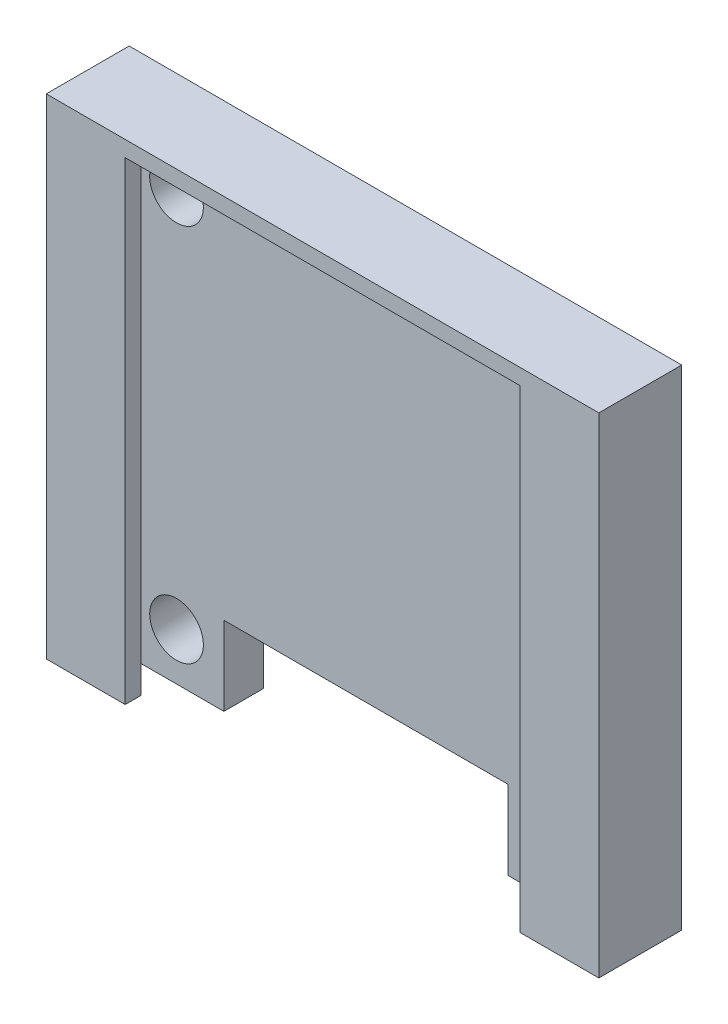
ISO-10303-21;
HEADER;
FILE_DESCRIPTION(('STEP AP214'),'2;1');
FILE_NAME('part.step','',(''),(''),'','','');
FILE_SCHEMA(('AUTOMOTIVE_DESIGN { 1 0 10303 214 1 1 1 1 }'));
ENDSEC;
DATA;
#1=APPLICATION_CONTEXT('core data for automotive mechanical design processes');
#2=APPLICATION_PROTOCOL_DEFINITION('international standard','automotive_design',2000,#1);
#3=PRODUCT_CONTEXT('',#1,'mechanical');
#4=PRODUCT('Part','Part','',(#3));
#5=PRODUCT_RELATED_PRODUCT_CATEGORY('part','',(#4));
#6=PRODUCT_DEFINITION_FORMATION('','',#4);
#7=PRODUCT_DEFINITION_CONTEXT('part definition',#1,'design');
#8=PRODUCT_DEFINITION('design','',#6,#7);
#9=PRODUCT_DEFINITION_SHAPE('','',#8);
#10=(LENGTH_UNIT() NAMED_UNIT(*) SI_UNIT(.MILLI.,.METRE.));
#11=(NAMED_UNIT(*) PLANE_ANGLE_UNIT() SI_UNIT($,.RADIAN.));
#12=(NAMED_UNIT(*) SI_UNIT($,.STERADIAN.) SOLID_ANGLE_UNIT());
#13=UNCERTAINTY_MEASURE_WITH_UNIT(LENGTH_MEASURE(1.E-05),#10,'distance_accuracy_value','');
#14=(GEOMETRIC_REPRESENTATION_CONTEXT(3) GLOBAL_UNCERTAINTY_ASSIGNED_CONTEXT((#13)) GLOBAL_UNIT_ASSIGNED_CONTEXT((#10,
#11,#12)) REPRESENTATION_CONTEXT('',''));
#15=CARTESIAN_POINT('',(0.,0.,0.));
#16=DIRECTION('',(0.,0.,1.));
#17=DIRECTION('',(1.,0.,0.));
#18=AXIS2_PLACEMENT_3D('',#15,#16,#17);
#19=CARTESIAN_POINT('',(0.,0.,2.5));
#20=DIRECTION('',(0.,0.,1.));
#21=DIRECTION('',(1.,0.,0.));
#22=AXIS2_PLACEMENT_3D('',#19,#20,#21);
#23=PLANE('',#22);
#24=CARTESIAN_POINT('',(29.5,27.,2.5));
#25=DIRECTION('',(0.,0.,-1.));
#26=DIRECTION('',(-1.,0.,0.));
#27=AXIS2_PLACEMENT_3D('',#24,#25,#26);
#28=CIRCLE('',#27,1.7);
#29=CARTESIAN_POINT('',(27.8,27.,2.5));
#30=VERTEX_POINT('',#29);
#31=EDGE_CURVE('E317',#30,#30,#28,.T.);
#32=ORIENTED_EDGE('',*,*,#31,.T.);
#33=EDGE_LOOP('',(#32));
#34=FACE_BOUND('',#33,.T.);
#35=CARTESIAN_POINT('',(5.5,27.,2.5));
#36=DIRECTION('',(0.,0.,1.));
#37=DIRECTION('',(1.,0.,0.));
#38=AXIS2_PLACEMENT_3D('',#35,#36,#37);
#39=CIRCLE('',#38,1.7);
#40=CARTESIAN_POINT('',(7.2,27.,2.5));
#41=VERTEX_POINT('',#40);
#42=EDGE_CURVE('E335',#41,#41,#39,.T.);
#43=ORIENTED_EDGE('',*,*,#42,.F.);
#44=EDGE_LOOP('',(#43));
#45=FACE_BOUND('',#44,.T.);
#46=CARTESIAN_POINT('',(5.5,3.,2.5));
#47=DIRECTION('',(0.,0.,-1.));
#48=DIRECTION('',(-1.,0.,0.));
#49=AXIS2_PLACEMENT_3D('',#46,#47,#48);
#50=CIRCLE('',#49,1.7);
#51=CARTESIAN_POINT('',(3.8,3.,2.5));
#52=VERTEX_POINT('',#51);
#53=EDGE_CURVE('E329',#52,#52,#50,.T.);
#54=ORIENTED_EDGE('',*,*,#53,.T.);
#55=EDGE_LOOP('',(#54));
#56=FACE_BOUND('',#55,.T.);
#57=CARTESIAN_POINT('',(29.5,3.,2.5));
#58=DIRECTION('',(0.,0.,1.));
#59=DIRECTION('',(1.,0.,0.));
#60=AXIS2_PLACEMENT_3D('',#57,#58,#59);
#61=CIRCLE('',#60,1.7);
#62=CARTESIAN_POINT('',(31.2,3.,2.5));
#63=VERTEX_POINT('',#62);
#64=EDGE_CURVE('E323',#63,#63,#61,.T.);
#65=ORIENTED_EDGE('',*,*,#64,.F.);
#66=EDGE_LOOP('',(#65));
#67=FACE_BOUND('',#66,.T.);
#68=DIRECTION('',(1.,0.,0.));
#69=VECTOR('',#68,1.);
#70=CARTESIAN_POINT('',(0.,0.,2.5));
#71=LINE('',#70,#69);
#72=CARTESIAN_POINT('',(26.5,0.,2.5));
#73=VERTEX_POINT('',#72);
#74=CARTESIAN_POINT('',(32.4480950745121,0.,2.5));
#75=VERTEX_POINT('',#74);
#76=EDGE_CURVE('E344',#73,#75,#71,.T.);
#77=ORIENTED_EDGE('',*,*,#76,.T.);
#78=DIRECTION('',(0.,-1.,0.));
#79=VECTOR('',#78,1.);
#80=CARTESIAN_POINT('',(32.4480950745121,0.,2.5));
#81=LINE('',#80,#79);
#82=CARTESIAN_POINT('',(32.4480950745121,30.,2.5));
#83=VERTEX_POINT('',#82);
#84=EDGE_CURVE('E279',#83,#75,#81,.T.);
#85=ORIENTED_EDGE('',*,*,#84,.F.);
#86=DIRECTION('',(1.,0.,0.));
#87=VECTOR('',#86,1.);
#88=CARTESIAN_POINT('',(0.,30.,2.5));
#89=LINE('',#88,#87);
#90=CARTESIAN_POINT('',(2.55190492548787,30.,2.5));
#91=VERTEX_POINT('',#90);
#92=EDGE_CURVE('E343',#91,#83,#89,.T.);
#93=ORIENTED_EDGE('',*,*,#92,.F.);
#94=DIRECTION('',(0.,1.,0.));
#95=VECTOR('',#94,1.);
#96=CARTESIAN_POINT('',(2.55190492548787,0.,2.5));
#97=LINE('',#96,#95);
#98=CARTESIAN_POINT('',(2.55190492548787,0.,2.5));
#99=VERTEX_POINT('',#98);
#100=EDGE_CURVE('E109',#99,#91,#97,.T.);
#101=ORIENTED_EDGE('',*,*,#100,.F.);
#102=CARTESIAN_POINT('',(8.5,0.,2.5));
#103=VERTEX_POINT('',#102);
#104=EDGE_CURVE('E341',#99,#103,#71,.T.);
#105=ORIENTED_EDGE('',*,*,#104,.T.);
#106=DIRECTION('',(0.,-1.,0.));
#107=VECTOR('',#106,1.);
#108=CARTESIAN_POINT('',(8.5,0.,2.5));
#109=LINE('',#108,#107);
#110=CARTESIAN_POINT('',(8.5,5.,2.5));
#111=VERTEX_POINT('',#110);
#112=EDGE_CURVE('E299',#111,#103,#109,.T.);
#113=ORIENTED_EDGE('',*,*,#112,.F.);
#114=DIRECTION('',(-1.,0.,0.));
#115=VECTOR('',#114,1.);
#116=CARTESIAN_POINT('',(8.5,5.,2.5));
#117=LINE('',#116,#115);
#118=CARTESIAN_POINT('',(26.5,5.,2.5));
#119=VERTEX_POINT('',#118);
#120=EDGE_CURVE('E305',#119,#111,#117,.T.);
#121=ORIENTED_EDGE('',*,*,#120,.F.);
#122=DIRECTION('',(0.,1.,0.));
#123=VECTOR('',#122,1.);
#124=CARTESIAN_POINT('',(26.5,0.,2.5));
#125=LINE('',#124,#123);
#126=EDGE_CURVE('E302',#73,#119,#125,.T.);
#127=ORIENTED_EDGE('',*,*,#126,.F.);
#128=EDGE_LOOP('',(#77,#85,#93,#101,#105,#113,#121,#127));
#129=FACE_BOUND('',#128,.T.);
#130=ADVANCED_FACE('F94',(#34,#45,#56,#67,#129),#23,.T.);
#131=CARTESIAN_POINT('',(0.,0.,2.5));
#132=DIRECTION('',(0.,1.,0.));
#133=DIRECTION('',(-1.,0.,0.));
#134=AXIS2_PLACEMENT_3D('',#131,#132,#133);
#135=PLANE('',#134);
#136=DIRECTION('',(1.,0.,0.));
#137=VECTOR('',#136,1.);
#138=CARTESIAN_POINT('',(0.,0.,0.));
#139=LINE('',#138,#137);
#140=CARTESIAN_POINT('',(0.,0.,0.));
#141=VERTEX_POINT('',#140);
#142=CARTESIAN_POINT('',(8.5,0.,0.));
#143=VERTEX_POINT('',#142);
#144=EDGE_CURVE('E346',#141,#143,#139,.T.);
#145=ORIENTED_EDGE('',*,*,#144,.T.);
#146=DIRECTION('',(0.,0.,1.));
#147=VECTOR('',#146,1.);
#148=CARTESIAN_POINT('',(8.5,0.,2.5));
#149=LINE('',#148,#147);
#150=EDGE_CURVE('E102',#143,#103,#149,.T.);
#151=ORIENTED_EDGE('',*,*,#150,.T.);
#152=ORIENTED_EDGE('',*,*,#104,.F.);
#153=DIRECTION('',(0.,0.,-1.));
#154=VECTOR('',#153,1.);
#155=CARTESIAN_POINT('',(2.55190492548787,0.,4.25));
#156=LINE('',#155,#154);
#157=CARTESIAN_POINT('',(2.55190492548787,0.,4.25));
#158=VERTEX_POINT('',#157);
#159=EDGE_CURVE('E296',#158,#99,#156,.T.);
#160=ORIENTED_EDGE('',*,*,#159,.F.);
#161=DIRECTION('',(1.,0.,0.));
#162=VECTOR('',#161,1.);
#163=CARTESIAN_POINT('',(0.,0.,4.25));
#164=LINE('',#163,#162);
#165=CARTESIAN_POINT('',(5.,0.,4.25));
#166=VERTEX_POINT('',#165);
#167=EDGE_CURVE('E265',#158,#166,#164,.T.);
#168=ORIENTED_EDGE('',*,*,#167,.T.);
#169=DIRECTION('',(0.,0.,-1.));
#170=VECTOR('',#169,1.);
#171=CARTESIAN_POINT('',(5.,0.,5.25));
#172=LINE('',#171,#170);
#173=CARTESIAN_POINT('',(5.,0.,5.25));
#174=VERTEX_POINT('',#173);
#175=EDGE_CURVE('E268',#174,#166,#172,.T.);
#176=ORIENTED_EDGE('',*,*,#175,.F.);
#177=DIRECTION('',(1.,0.,0.));
#178=VECTOR('',#177,1.);
#179=CARTESIAN_POINT('',(0.,0.,5.25));
#180=LINE('',#179,#178);
#181=CARTESIAN_POINT('',(0.,0.,5.25));
#182=VERTEX_POINT('',#181);
#183=EDGE_CURVE('E218',#182,#174,#180,.T.);
#184=ORIENTED_EDGE('',*,*,#183,.F.);
#185=DIRECTION('',(0.,0.,-1.));
#186=VECTOR('',#185,1.);
#187=CARTESIAN_POINT('',(0.,0.,2.5));
#188=LINE('',#187,#186);
#189=EDGE_CURVE('E215',#182,#141,#188,.T.);
#190=ORIENTED_EDGE('',*,*,#189,.T.);
#191=EDGE_LOOP('',(#145,#151,#152,#160,#168,#176,#184,#190));
#192=FACE_BOUND('',#191,.T.);
#193=ADVANCED_FACE('F360',(#192),#135,.F.);
#194=CARTESIAN_POINT('',(0.,0.,0.));
#195=DIRECTION('',(0.,0.,1.));
#196=DIRECTION('',(1.,0.,0.));
#197=AXIS2_PLACEMENT_3D('',#194,#195,#196);
#198=PLANE('',#197);
#199=CARTESIAN_POINT('',(29.5,27.,0.));
#200=DIRECTION('',(0.,0.,-1.));
#201=DIRECTION('',(-1.,0.,0.));
#202=AXIS2_PLACEMENT_3D('',#199,#200,#201);
#203=CIRCLE('',#202,1.7);
#204=CARTESIAN_POINT('',(27.8,27.,0.));
#205=VERTEX_POINT('',#204);
#206=EDGE_CURVE('E316',#205,#205,#203,.T.);
#207=ORIENTED_EDGE('',*,*,#206,.F.);
#208=EDGE_LOOP('',(#207));
#209=FACE_BOUND('',#208,.T.);
#210=CARTESIAN_POINT('',(5.5,3.,0.));
#211=DIRECTION('',(0.,0.,-1.));
#212=DIRECTION('',(-1.,0.,0.));
#213=AXIS2_PLACEMENT_3D('',#210,#211,#212);
#214=CIRCLE('',#213,1.7);
#215=CARTESIAN_POINT('',(3.8,3.,0.));
#216=VERTEX_POINT('',#215);
#217=EDGE_CURVE('E326',#216,#216,#214,.T.);
#218=ORIENTED_EDGE('',*,*,#217,.F.);
#219=EDGE_LOOP('',(#218));
#220=FACE_BOUND('',#219,.T.);
#221=DIRECTION('',(-1.,0.,0.));
#222=VECTOR('',#221,1.);
#223=CARTESIAN_POINT('',(0.,5.,0.));
#224=LINE('',#223,#222);
#225=CARTESIAN_POINT('',(26.5,5.,0.));
#226=VERTEX_POINT('',#225);
#227=CARTESIAN_POINT('',(8.5,5.,0.));
#228=VERTEX_POINT('',#227);
#229=EDGE_CURVE('E12',#226,#228,#224,.T.);
#230=ORIENTED_EDGE('',*,*,#229,.T.);
#231=DIRECTION('',(0.,-1.,0.));
#232=VECTOR('',#231,1.);
#233=CARTESIAN_POINT('',(8.5,0.,0.));
#234=LINE('',#233,#232);
#235=EDGE_CURVE('E313',#228,#143,#234,.T.);
#236=ORIENTED_EDGE('',*,*,#235,.T.);
#237=ORIENTED_EDGE('',*,*,#144,.F.);
#238=DIRECTION('',(0.,1.,0.));
#239=VECTOR('',#238,1.);
#240=CARTESIAN_POINT('',(0.,0.,0.));
#241=LINE('',#240,#239);
#242=CARTESIAN_POINT('',(0.,31.,0.));
#243=VERTEX_POINT('',#242);
#244=EDGE_CURVE('E351',#141,#243,#241,.T.);
#245=ORIENTED_EDGE('',*,*,#244,.T.);
#246=DIRECTION('',(-1.,0.,0.));
#247=VECTOR('',#246,1.);
#248=CARTESIAN_POINT('',(0.,31.,0.));
#249=LINE('',#248,#247);
#250=CARTESIAN_POINT('',(35.,31.,0.));
#251=VERTEX_POINT('',#250);
#252=EDGE_CURVE('E236',#251,#243,#249,.T.);
#253=ORIENTED_EDGE('',*,*,#252,.F.);
#254=DIRECTION('',(0.,1.,0.));
#255=VECTOR('',#254,1.);
#256=CARTESIAN_POINT('',(35.,0.,0.));
#257=LINE('',#256,#255);
#258=CARTESIAN_POINT('',(35.,0.,0.));
#259=VERTEX_POINT('',#258);
#260=EDGE_CURVE('E349',#259,#251,#257,.T.);
#261=ORIENTED_EDGE('',*,*,#260,.F.);
#262=CARTESIAN_POINT('',(26.5,0.,0.));
#263=VERTEX_POINT('',#262);
#264=EDGE_CURVE('E338',#263,#259,#139,.T.);
#265=ORIENTED_EDGE('',*,*,#264,.F.);
#266=DIRECTION('',(0.,1.,0.));
#267=VECTOR('',#266,1.);
#268=CARTESIAN_POINT('',(26.5,0.,0.));
#269=LINE('',#268,#267);
#270=EDGE_CURVE('E117',#263,#226,#269,.T.);
#271=ORIENTED_EDGE('',*,*,#270,.T.);
#272=EDGE_LOOP('',(#230,#236,#237,#245,#253,#261,#265,#271));
#273=FACE_BOUND('',#272,.T.);
#274=CARTESIAN_POINT('',(5.5,27.,0.));
#275=DIRECTION('',(0.,0.,1.));
#276=DIRECTION('',(1.,0.,0.));
#277=AXIS2_PLACEMENT_3D('',#274,#275,#276);
#278=CIRCLE('',#277,1.7);
#279=CARTESIAN_POINT('',(7.2,27.,0.));
#280=VERTEX_POINT('',#279);
#281=EDGE_CURVE('E332',#280,#280,#278,.T.);
#282=ORIENTED_EDGE('',*,*,#281,.T.);
#283=EDGE_LOOP('',(#282));
#284=FACE_BOUND('',#283,.T.);
#285=CARTESIAN_POINT('',(29.5,3.,0.));
#286=DIRECTION('',(0.,0.,1.));
#287=DIRECTION('',(1.,0.,0.));
#288=AXIS2_PLACEMENT_3D('',#285,#286,#287);
#289=CIRCLE('',#288,1.7);
#290=CARTESIAN_POINT('',(31.2,3.,0.));
#291=VERTEX_POINT('',#290);
#292=EDGE_CURVE('E320',#291,#291,#289,.T.);
#293=ORIENTED_EDGE('',*,*,#292,.T.);
#294=EDGE_LOOP('',(#293));
#295=FACE_BOUND('',#294,.T.);
#296=ADVANCED_FACE('F368',(#209,#220,#273,#284,#295),#198,.F.);
#297=ORIENTED_EDGE('',*,*,#76,.F.);
#298=DIRECTION('',(0.,0.,-1.));
#299=VECTOR('',#298,1.);
#300=CARTESIAN_POINT('',(26.5,0.,2.5));
#301=LINE('',#300,#299);
#302=EDGE_CURVE('E357',#73,#263,#301,.T.);
#303=ORIENTED_EDGE('',*,*,#302,.T.);
#304=ORIENTED_EDGE('',*,*,#264,.T.);
#305=DIRECTION('',(0.,0.,-1.));
#306=VECTOR('',#305,1.);
#307=CARTESIAN_POINT('',(35.,0.,2.5));
#308=LINE('',#307,#306);
#309=CARTESIAN_POINT('',(35.,0.,5.25));
#310=VERTEX_POINT('',#309);
#311=EDGE_CURVE('E354',#310,#259,#308,.T.);
#312=ORIENTED_EDGE('',*,*,#311,.F.);
#313=DIRECTION('',(-1.,0.,0.));
#314=VECTOR('',#313,1.);
#315=CARTESIAN_POINT('',(0.,0.,5.25));
#316=LINE('',#315,#314);
#317=CARTESIAN_POINT('',(30.,0.,5.25));
#318=VERTEX_POINT('',#317);
#319=EDGE_CURVE('E249',#310,#318,#316,.T.);
#320=ORIENTED_EDGE('',*,*,#319,.T.);
#321=DIRECTION('',(0.,0.,-1.));
#322=VECTOR('',#321,1.);
#323=CARTESIAN_POINT('',(30.,0.,5.25));
#324=LINE('',#323,#322);
#325=CARTESIAN_POINT('',(30.,0.,4.25));
#326=VERTEX_POINT('',#325);
#327=EDGE_CURVE('E252',#318,#326,#324,.T.);
#328=ORIENTED_EDGE('',*,*,#327,.T.);
#329=DIRECTION('',(-1.,0.,0.));
#330=VECTOR('',#329,1.);
#331=CARTESIAN_POINT('',(0.,0.,4.25));
#332=LINE('',#331,#330);
#333=CARTESIAN_POINT('',(32.4480950745121,0.,4.25));
#334=VERTEX_POINT('',#333);
#335=EDGE_CURVE('E247',#334,#326,#332,.T.);
#336=ORIENTED_EDGE('',*,*,#335,.F.);
#337=DIRECTION('',(0.,0.,-1.));
#338=VECTOR('',#337,1.);
#339=CARTESIAN_POINT('',(32.4480950745121,0.,4.25));
#340=LINE('',#339,#338);
#341=EDGE_CURVE('E283',#334,#75,#340,.T.);
#342=ORIENTED_EDGE('',*,*,#341,.T.);
#343=EDGE_LOOP('',(#297,#303,#304,#312,#320,#328,#336,#342));
#344=FACE_BOUND('',#343,.T.);
#345=ADVANCED_FACE('F96',(#344),#135,.F.);
#346=CARTESIAN_POINT('',(35.,0.,2.5));
#347=DIRECTION('',(-1.,0.,0.));
#348=DIRECTION('',(0.,0.,1.));
#349=AXIS2_PLACEMENT_3D('',#346,#347,#348);
#350=PLANE('',#349);
#351=ORIENTED_EDGE('',*,*,#260,.T.);
#352=DIRECTION('',(0.,0.,-1.));
#353=VECTOR('',#352,1.);
#354=CARTESIAN_POINT('',(35.,31.,0.));
#355=LINE('',#354,#353);
#356=CARTESIAN_POINT('',(35.,31.,5.25));
#357=VERTEX_POINT('',#356);
#358=EDGE_CURVE('E231',#357,#251,#355,.T.);
#359=ORIENTED_EDGE('',*,*,#358,.F.);
#360=DIRECTION('',(0.,-1.,0.));
#361=VECTOR('',#360,1.);
#362=CARTESIAN_POINT('',(35.,0.,5.25));
#363=LINE('',#362,#361);
#364=EDGE_CURVE('E227',#357,#310,#363,.T.);
#365=ORIENTED_EDGE('',*,*,#364,.T.);
#366=ORIENTED_EDGE('',*,*,#311,.T.);
#367=EDGE_LOOP('',(#351,#359,#365,#366));
#368=FACE_BOUND('',#367,.T.);
#369=ADVANCED_FACE('F394',(#368),#350,.F.);
#370=CARTESIAN_POINT('',(0.,0.,2.5));
#371=DIRECTION('',(-1.,0.,0.));
#372=DIRECTION('',(0.,-1.,0.));
#373=AXIS2_PLACEMENT_3D('',#370,#371,#372);
#374=PLANE('',#373);
#375=ORIENTED_EDGE('',*,*,#244,.F.);
#376=ORIENTED_EDGE('',*,*,#189,.F.);
#377=DIRECTION('',(0.,-1.,0.));
#378=VECTOR('',#377,1.);
#379=CARTESIAN_POINT('',(0.,0.,5.25));
#380=LINE('',#379,#378);
#381=CARTESIAN_POINT('',(0.,31.,5.25));
#382=VERTEX_POINT('',#381);
#383=EDGE_CURVE('E209',#382,#182,#380,.T.);
#384=ORIENTED_EDGE('',*,*,#383,.F.);
#385=DIRECTION('',(0.,0.,1.));
#386=VECTOR('',#385,1.);
#387=CARTESIAN_POINT('',(0.,31.,0.));
#388=LINE('',#387,#386);
#389=EDGE_CURVE('E214',#243,#382,#388,.T.);
#390=ORIENTED_EDGE('',*,*,#389,.F.);
#391=EDGE_LOOP('',(#375,#376,#384,#390));
#392=FACE_BOUND('',#391,.T.);
#393=ADVANCED_FACE('F212',(#392),#374,.T.);
#394=CARTESIAN_POINT('',(5.5,27.,2.5));
#395=DIRECTION('',(0.,0.,-1.));
#396=DIRECTION('',(-1.,0.,0.));
#397=AXIS2_PLACEMENT_3D('',#394,#395,#396);
#398=CYLINDRICAL_SURFACE('',#397,1.7);
#399=ORIENTED_EDGE('',*,*,#42,.T.);
#400=EDGE_LOOP('',(#399));
#401=FACE_BOUND('',#400,.T.);
#402=ORIENTED_EDGE('',*,*,#281,.F.);
#403=EDGE_LOOP('',(#402));
#404=FACE_BOUND('',#403,.T.);
#405=ADVANCED_FACE('F388',(#401,#404),#398,.F.);
#406=CARTESIAN_POINT('',(5.5,3.,2.5));
#407=DIRECTION('',(0.,0.,-1.));
#408=DIRECTION('',(-1.,0.,0.));
#409=AXIS2_PLACEMENT_3D('',#406,#407,#408);
#410=CYLINDRICAL_SURFACE('',#409,1.7);
#411=ORIENTED_EDGE('',*,*,#53,.F.);
#412=EDGE_LOOP('',(#411));
#413=FACE_BOUND('',#412,.T.);
#414=ORIENTED_EDGE('',*,*,#217,.T.);
#415=EDGE_LOOP('',(#414));
#416=FACE_BOUND('',#415,.T.);
#417=ADVANCED_FACE('F447',(#413,#416),#410,.F.);
#418=CARTESIAN_POINT('',(29.5,3.,2.5));
#419=DIRECTION('',(0.,0.,-1.));
#420=DIRECTION('',(-1.,0.,0.));
#421=AXIS2_PLACEMENT_3D('',#418,#419,#420);
#422=CYLINDRICAL_SURFACE('',#421,1.7);
#423=ORIENTED_EDGE('',*,*,#64,.T.);
#424=EDGE_LOOP('',(#423));
#425=FACE_BOUND('',#424,.T.);
#426=ORIENTED_EDGE('',*,*,#292,.F.);
#427=EDGE_LOOP('',(#426));
#428=FACE_BOUND('',#427,.T.);
#429=ADVANCED_FACE('F444',(#425,#428),#422,.F.);
#430=CARTESIAN_POINT('',(29.5,27.,2.5));
#431=DIRECTION('',(0.,0.,-1.));
#432=DIRECTION('',(-1.,0.,0.));
#433=AXIS2_PLACEMENT_3D('',#430,#431,#432);
#434=CYLINDRICAL_SURFACE('',#433,1.7);
#435=ORIENTED_EDGE('',*,*,#31,.F.);
#436=EDGE_LOOP('',(#435));
#437=FACE_BOUND('',#436,.T.);
#438=ORIENTED_EDGE('',*,*,#206,.T.);
#439=EDGE_LOOP('',(#438));
#440=FACE_BOUND('',#439,.T.);
#441=ADVANCED_FACE('F438',(#437,#440),#434,.F.);
#442=CARTESIAN_POINT('',(8.5,5.,-2.5));
#443=DIRECTION('',(0.,1.,0.));
#444=DIRECTION('',(0.,0.,1.));
#445=AXIS2_PLACEMENT_3D('',#442,#443,#444);
#446=PLANE('',#445);
#447=DIRECTION('',(0.,0.,1.));
#448=VECTOR('',#447,1.);
#449=CARTESIAN_POINT('',(26.5,5.,-2.5));
#450=LINE('',#449,#448);
#451=EDGE_CURVE('E308',#226,#119,#450,.T.);
#452=ORIENTED_EDGE('',*,*,#451,.T.);
#453=ORIENTED_EDGE('',*,*,#120,.T.);
#454=DIRECTION('',(0.,0.,1.));
#455=VECTOR('',#454,1.);
#456=CARTESIAN_POINT('',(8.5,5.,-2.5));
#457=LINE('',#456,#455);
#458=EDGE_CURVE('E309',#228,#111,#457,.T.);
#459=ORIENTED_EDGE('',*,*,#458,.F.);
#460=ORIENTED_EDGE('',*,*,#229,.F.);
#461=EDGE_LOOP('',(#452,#453,#459,#460));
#462=FACE_BOUND('',#461,.T.);
#463=ADVANCED_FACE('F372',(#462),#446,.F.);
#464=CARTESIAN_POINT('',(8.5,0.,-2.5));
#465=DIRECTION('',(-1.,0.,0.));
#466=DIRECTION('',(0.,0.,1.));
#467=AXIS2_PLACEMENT_3D('',#464,#465,#466);
#468=PLANE('',#467);
#469=ORIENTED_EDGE('',*,*,#458,.T.);
#470=ORIENTED_EDGE('',*,*,#112,.T.);
#471=ORIENTED_EDGE('',*,*,#150,.F.);
#472=ORIENTED_EDGE('',*,*,#235,.F.);
#473=EDGE_LOOP('',(#469,#470,#471,#472));
#474=FACE_BOUND('',#473,.T.);
#475=ADVANCED_FACE('F364',(#474),#468,.F.);
#476=CARTESIAN_POINT('',(26.5,0.,-2.5));
#477=DIRECTION('',(1.,0.,0.));
#478=DIRECTION('',(0.,0.,-1.));
#479=AXIS2_PLACEMENT_3D('',#476,#477,#478);
#480=PLANE('',#479);
#481=ORIENTED_EDGE('',*,*,#302,.F.);
#482=ORIENTED_EDGE('',*,*,#126,.T.);
#483=ORIENTED_EDGE('',*,*,#451,.F.);
#484=ORIENTED_EDGE('',*,*,#270,.F.);
#485=EDGE_LOOP('',(#481,#482,#483,#484));
#486=FACE_BOUND('',#485,.T.);
#487=ADVANCED_FACE('F373',(#486),#480,.F.);
#488=CARTESIAN_POINT('',(2.55190492548787,0.,4.25));
#489=DIRECTION('',(-1.,0.,0.));
#490=DIRECTION('',(0.,0.,1.));
#491=AXIS2_PLACEMENT_3D('',#488,#489,#490);
#492=PLANE('',#491);
#493=ORIENTED_EDGE('',*,*,#100,.T.);
#494=DIRECTION('',(0.,0.,-1.));
#495=VECTOR('',#494,1.);
#496=CARTESIAN_POINT('',(2.55190492548787,30.,4.25));
#497=LINE('',#496,#495);
#498=CARTESIAN_POINT('',(2.55190492548787,30.,4.25));
#499=VERTEX_POINT('',#498);
#500=EDGE_CURVE('E293',#499,#91,#497,.T.);
#501=ORIENTED_EDGE('',*,*,#500,.F.);
#502=DIRECTION('',(0.,1.,0.));
#503=VECTOR('',#502,1.);
#504=CARTESIAN_POINT('',(2.55190492548787,0.,4.25));
#505=LINE('',#504,#503);
#506=EDGE_CURVE('E290',#158,#499,#505,.T.);
#507=ORIENTED_EDGE('',*,*,#506,.F.);
#508=ORIENTED_EDGE('',*,*,#159,.T.);
#509=EDGE_LOOP('',(#493,#501,#507,#508));
#510=FACE_BOUND('',#509,.T.);
#511=ADVANCED_FACE('F426',(#510),#492,.F.);
#512=CARTESIAN_POINT('',(32.4480950745121,0.,4.25));
#513=DIRECTION('',(1.,0.,0.));
#514=DIRECTION('',(0.,1.,0.));
#515=AXIS2_PLACEMENT_3D('',#512,#513,#514);
#516=PLANE('',#515);
#517=ORIENTED_EDGE('',*,*,#84,.T.);
#518=ORIENTED_EDGE('',*,*,#341,.F.);
#519=DIRECTION('',(0.,-1.,0.));
#520=VECTOR('',#519,1.);
#521=CARTESIAN_POINT('',(32.4480950745121,0.,4.25));
#522=LINE('',#521,#520);
#523=CARTESIAN_POINT('',(32.4480950745121,30.,4.25));
#524=VERTEX_POINT('',#523);
#525=EDGE_CURVE('E280',#524,#334,#522,.T.);
#526=ORIENTED_EDGE('',*,*,#525,.F.);
#527=DIRECTION('',(0.,0.,-1.));
#528=VECTOR('',#527,1.);
#529=CARTESIAN_POINT('',(32.4480950745121,30.,4.25));
#530=LINE('',#529,#528);
#531=EDGE_CURVE('E287',#524,#83,#530,.T.);
#532=ORIENTED_EDGE('',*,*,#531,.T.);
#533=EDGE_LOOP('',(#517,#518,#526,#532));
#534=FACE_BOUND('',#533,.T.);
#535=ADVANCED_FACE('F405',(#534),#516,.F.);
#536=CARTESIAN_POINT('',(0.,0.,4.25));
#537=DIRECTION('',(0.,0.,1.));
#538=DIRECTION('',(1.,0.,0.));
#539=AXIS2_PLACEMENT_3D('',#536,#537,#538);
#540=PLANE('',#539);
#541=ORIENTED_EDGE('',*,*,#167,.F.);
#542=ORIENTED_EDGE('',*,*,#506,.T.);
#543=DIRECTION('',(1.,0.,0.));
#544=VECTOR('',#543,1.);
#545=CARTESIAN_POINT('',(0.,30.,4.25));
#546=LINE('',#545,#544);
#547=CARTESIAN_POINT('',(5.,30.,4.25));
#548=VERTEX_POINT('',#547);
#549=EDGE_CURVE('E271',#499,#548,#546,.T.);
#550=ORIENTED_EDGE('',*,*,#549,.T.);
#551=DIRECTION('',(0.,-1.,0.));
#552=VECTOR('',#551,1.);
#553=CARTESIAN_POINT('',(5.,0.,4.25));
#554=LINE('',#553,#552);
#555=EDGE_CURVE('E263',#548,#166,#554,.T.);
#556=ORIENTED_EDGE('',*,*,#555,.T.);
#557=EDGE_LOOP('',(#541,#542,#550,#556));
#558=FACE_BOUND('',#557,.T.);
#559=ADVANCED_FACE('F423',(#558),#540,.F.);
#560=CARTESIAN_POINT('',(5.,0.,5.25));
#561=DIRECTION('',(1.,0.,0.));
#562=DIRECTION('',(0.,1.,0.));
#563=AXIS2_PLACEMENT_3D('',#560,#561,#562);
#564=PLANE('',#563);
#565=ORIENTED_EDGE('',*,*,#555,.F.);
#566=DIRECTION('',(0.,0.,-1.));
#567=VECTOR('',#566,1.);
#568=CARTESIAN_POINT('',(5.,30.,5.25));
#569=LINE('',#568,#567);
#570=CARTESIAN_POINT('',(5.,30.,5.25));
#571=VERTEX_POINT('',#570);
#572=EDGE_CURVE('E277',#571,#548,#569,.T.);
#573=ORIENTED_EDGE('',*,*,#572,.F.);
#574=DIRECTION('',(0.,-1.,0.));
#575=VECTOR('',#574,1.);
#576=CARTESIAN_POINT('',(5.,0.,5.25));
#577=LINE('',#576,#575);
#578=EDGE_CURVE('E219',#571,#174,#577,.T.);
#579=ORIENTED_EDGE('',*,*,#578,.T.);
#580=ORIENTED_EDGE('',*,*,#175,.T.);
#581=EDGE_LOOP('',(#565,#573,#579,#580));
#582=FACE_BOUND('',#581,.T.);
#583=ADVANCED_FACE('F419',(#582),#564,.T.);
#584=CARTESIAN_POINT('',(0.,0.,5.25));
#585=DIRECTION('',(0.,0.,1.));
#586=DIRECTION('',(1.,0.,0.));
#587=AXIS2_PLACEMENT_3D('',#584,#585,#586);
#588=PLANE('',#587);
#589=ORIENTED_EDGE('',*,*,#578,.F.);
#590=DIRECTION('',(1.,0.,0.));
#591=VECTOR('',#590,1.);
#592=CARTESIAN_POINT('',(0.,30.,5.25));
#593=LINE('',#592,#591);
#594=CARTESIAN_POINT('',(30.,30.,5.25));
#595=VERTEX_POINT('',#594);
#596=EDGE_CURVE('E237',#571,#595,#593,.T.);
#597=ORIENTED_EDGE('',*,*,#596,.T.);
#598=DIRECTION('',(0.,-1.,0.));
#599=VECTOR('',#598,1.);
#600=CARTESIAN_POINT('',(30.,0.,5.25));
#601=LINE('',#600,#599);
#602=EDGE_CURVE('E246',#595,#318,#601,.T.);
#603=ORIENTED_EDGE('',*,*,#602,.T.);
#604=ORIENTED_EDGE('',*,*,#319,.F.);
#605=ORIENTED_EDGE('',*,*,#364,.F.);
#606=DIRECTION('',(1.,0.,0.));
#607=VECTOR('',#606,1.);
#608=CARTESIAN_POINT('',(0.,31.,5.25));
#609=LINE('',#608,#607);
#610=EDGE_CURVE('E222',#382,#357,#609,.T.);
#611=ORIENTED_EDGE('',*,*,#610,.F.);
#612=ORIENTED_EDGE('',*,*,#383,.T.);
#613=ORIENTED_EDGE('',*,*,#183,.T.);
#614=EDGE_LOOP('',(#589,#597,#603,#604,#605,#611,#612,#613));
#615=FACE_BOUND('',#614,.T.);
#616=ADVANCED_FACE('F224',(#615),#588,.T.);
#617=CARTESIAN_POINT('',(0.,0.,4.25));
#618=DIRECTION('',(0.,0.,1.));
#619=DIRECTION('',(1.,0.,0.));
#620=AXIS2_PLACEMENT_3D('',#617,#618,#619);
#621=PLANE('',#620);
#622=DIRECTION('',(-1.,0.,0.));
#623=VECTOR('',#622,1.);
#624=CARTESIAN_POINT('',(0.,30.,4.25));
#625=LINE('',#624,#623);
#626=CARTESIAN_POINT('',(30.,30.,4.25));
#627=VERTEX_POINT('',#626);
#628=EDGE_CURVE('E243',#524,#627,#625,.T.);
#629=ORIENTED_EDGE('',*,*,#628,.F.);
#630=ORIENTED_EDGE('',*,*,#525,.T.);
#631=ORIENTED_EDGE('',*,*,#335,.T.);
#632=DIRECTION('',(0.,-1.,0.));
#633=VECTOR('',#632,1.);
#634=CARTESIAN_POINT('',(30.,0.,4.25));
#635=LINE('',#634,#633);
#636=EDGE_CURVE('E254',#627,#326,#635,.T.);
#637=ORIENTED_EDGE('',*,*,#636,.F.);
#638=EDGE_LOOP('',(#629,#630,#631,#637));
#639=FACE_BOUND('',#638,.T.);
#640=ADVANCED_FACE('F408',(#639),#621,.F.);
#641=CARTESIAN_POINT('',(30.,0.,5.25));
#642=DIRECTION('',(1.,0.,0.));
#643=DIRECTION('',(0.,1.,0.));
#644=AXIS2_PLACEMENT_3D('',#641,#642,#643);
#645=PLANE('',#644);
#646=ORIENTED_EDGE('',*,*,#636,.T.);
#647=ORIENTED_EDGE('',*,*,#327,.F.);
#648=ORIENTED_EDGE('',*,*,#602,.F.);
#649=DIRECTION('',(0.,0.,-1.));
#650=VECTOR('',#649,1.);
#651=CARTESIAN_POINT('',(30.,30.,5.25));
#652=LINE('',#651,#650);
#653=EDGE_CURVE('E260',#595,#627,#652,.T.);
#654=ORIENTED_EDGE('',*,*,#653,.T.);
#655=EDGE_LOOP('',(#646,#647,#648,#654));
#656=FACE_BOUND('',#655,.T.);
#657=ADVANCED_FACE('F414',(#656),#645,.F.);
#658=CARTESIAN_POINT('',(0.,30.,0.));
#659=DIRECTION('',(0.,1.,0.));
#660=DIRECTION('',(-1.,0.,0.));
#661=AXIS2_PLACEMENT_3D('',#658,#659,#660);
#662=PLANE('',#661);
#663=ORIENTED_EDGE('',*,*,#596,.F.);
#664=ORIENTED_EDGE('',*,*,#572,.T.);
#665=ORIENTED_EDGE('',*,*,#549,.F.);
#666=ORIENTED_EDGE('',*,*,#500,.T.);
#667=ORIENTED_EDGE('',*,*,#92,.T.);
#668=ORIENTED_EDGE('',*,*,#531,.F.);
#669=ORIENTED_EDGE('',*,*,#628,.T.);
#670=ORIENTED_EDGE('',*,*,#653,.F.);
#671=EDGE_LOOP('',(#663,#664,#665,#666,#667,#668,#669,#670));
#672=FACE_BOUND('',#671,.T.);
#673=ADVANCED_FACE('F411',(#672),#662,.F.);
#674=CARTESIAN_POINT('',(0.,31.,0.));
#675=DIRECTION('',(0.,1.,0.));
#676=DIRECTION('',(-1.,0.,0.));
#677=AXIS2_PLACEMENT_3D('',#674,#675,#676);
#678=PLANE('',#677);
#679=ORIENTED_EDGE('',*,*,#389,.T.);
#680=ORIENTED_EDGE('',*,*,#610,.T.);
#681=ORIENTED_EDGE('',*,*,#358,.T.);
#682=ORIENTED_EDGE('',*,*,#252,.T.);
#683=EDGE_LOOP('',(#679,#680,#681,#682));
#684=FACE_BOUND('',#683,.T.);
#685=ADVANCED_FACE('F234',(#684),#678,.T.);
#686=CLOSED_SHELL('',(#130,#193,#296,#345,#369,#393,#405,#417,#429,#441,#463,#475,#487,#511,
#535,#559,#583,#616,#640,#657,#673,#685));
#687=MANIFOLD_SOLID_BREP('B2',#686);
#688=ADVANCED_BREP_SHAPE_REPRESENTATION('',(#18,#687),#14);
#689=SHAPE_DEFINITION_REPRESENTATION(#9,#688);
ENDSEC;
END-ISO-10303-21;
